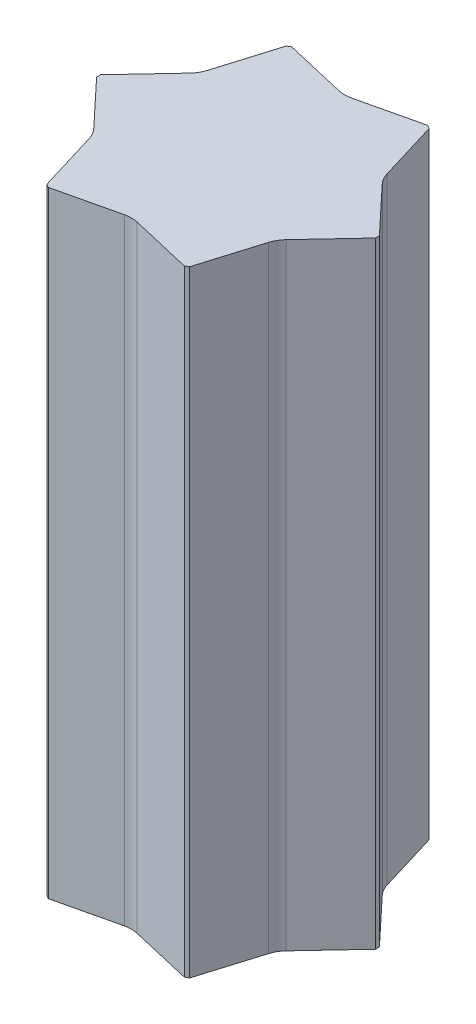
ISO-10303-21;
HEADER;
FILE_DESCRIPTION(('STEP AP214'),'2;1');
FILE_NAME('part.step','',(''),(''),'','','');
FILE_SCHEMA(('AUTOMOTIVE_DESIGN { 1 0 10303 214 1 1 1 1 }'));
ENDSEC;
DATA;
#1=APPLICATION_CONTEXT('core data for automotive mechanical design processes');
#2=APPLICATION_PROTOCOL_DEFINITION('international standard','automotive_design',2000,#1);
#3=PRODUCT_CONTEXT('',#1,'mechanical');
#4=PRODUCT('Part','Part','',(#3));
#5=PRODUCT_RELATED_PRODUCT_CATEGORY('part','',(#4));
#6=PRODUCT_DEFINITION_FORMATION('','',#4);
#7=PRODUCT_DEFINITION_CONTEXT('part definition',#1,'design');
#8=PRODUCT_DEFINITION('design','',#6,#7);
#9=PRODUCT_DEFINITION_SHAPE('','',#8);
#10=(LENGTH_UNIT() NAMED_UNIT(*) SI_UNIT(.MILLI.,.METRE.));
#11=(NAMED_UNIT(*) PLANE_ANGLE_UNIT() SI_UNIT($,.RADIAN.));
#12=(NAMED_UNIT(*) SI_UNIT($,.STERADIAN.) SOLID_ANGLE_UNIT());
#13=UNCERTAINTY_MEASURE_WITH_UNIT(LENGTH_MEASURE(1.E-05),#10,'distance_accuracy_value','');
#14=(GEOMETRIC_REPRESENTATION_CONTEXT(3) GLOBAL_UNCERTAINTY_ASSIGNED_CONTEXT((#13)) GLOBAL_UNIT_ASSIGNED_CONTEXT((#10,
#11,#12)) REPRESENTATION_CONTEXT('',''));
#15=CARTESIAN_POINT('',(0.,0.,0.));
#16=DIRECTION('',(0.,0.,1.));
#17=DIRECTION('',(1.,0.,0.));
#18=AXIS2_PLACEMENT_3D('',#15,#16,#17);
#19=CARTESIAN_POINT('',(-15.2728406860459,1480.,-257.829132307573));
#20=DIRECTION('',(-0.227684068601676,0.,0.97373505888665));
#21=DIRECTION('',(0.97373505888665,0.,0.227684068601676));
#22=AXIS2_PLACEMENT_3D('',#19,#20,#21);
#23=PLANE('',#22);
#24=DIRECTION('',(-0.97373505888665,0.,-0.227684068601676));
#25=VECTOR('',#24,1.);
#26=CARTESIAN_POINT('',(-15.2728406860459,0.,-257.829132307573));
#27=LINE('',#26,#25);
#28=CARTESIAN_POINT('',(-15.2728407370872,0.,-257.829132089557));
#29=VERTEX_POINT('',#28);
#30=CARTESIAN_POINT('',(-163.42540728603,0.,-292.470977468036));
#31=VERTEX_POINT('',#30);
#32=EDGE_CURVE('E243',#29,#31,#27,.T.);
#33=ORIENTED_EDGE('',*,*,#32,.T.);
#34=DIRECTION('',(0.,-1.,0.));
#35=VECTOR('',#34,1.);
#36=CARTESIAN_POINT('',(-163.42540728603,1480.,-292.470977468036));
#37=LINE('',#36,#35);
#38=CARTESIAN_POINT('',(-163.42540728603,1480.,-292.470977468036));
#39=VERTEX_POINT('',#38);
#40=EDGE_CURVE('E11',#39,#31,#37,.T.);
#41=ORIENTED_EDGE('',*,*,#40,.F.);
#42=DIRECTION('',(-0.97373505888665,0.,-0.227684068601676));
#43=VECTOR('',#42,1.);
#44=CARTESIAN_POINT('',(-15.2728406860459,1480.,-257.829132307573));
#45=LINE('',#44,#43);
#46=CARTESIAN_POINT('',(-15.2728407370872,1480.,-257.829132089557));
#47=VERTEX_POINT('',#46);
#48=EDGE_CURVE('E311',#47,#39,#45,.T.);
#49=ORIENTED_EDGE('',*,*,#48,.F.);
#50=DIRECTION('',(0.,-1.,0.));
#51=VECTOR('',#50,1.);
#52=CARTESIAN_POINT('',(-15.2728407370872,1480.,-257.829132089557));
#53=LINE('',#52,#51);
#54=EDGE_CURVE('E239',#47,#29,#53,.T.);
#55=ORIENTED_EDGE('',*,*,#54,.T.);
#56=EDGE_LOOP('',(#33,#41,#49,#55));
#57=FACE_BOUND('',#56,.T.);
#58=ADVANCED_FACE('F43',(#57),#23,.F.);
#59=CARTESIAN_POINT('',(-163.42540728603,1480.,-292.470977468036));
#60=DIRECTION('',(0.499999999999996,0.,0.866025403784441));
#61=DIRECTION('',(0.866025403784441,0.,-0.499999999999996));
#62=AXIS2_PLACEMENT_3D('',#59,#60,#61);
#63=PLANE('',#62);
#64=DIRECTION('',(-0.866025403784441,0.,0.499999999999996));
#65=VECTOR('',#64,1.);
#66=CARTESIAN_POINT('',(-163.42540728603,0.,-292.470977468036));
#67=LINE('',#66,#65);
#68=CARTESIAN_POINT('',(-171.57459271397,0.,-287.766043067538));
#69=VERTEX_POINT('',#68);
#70=EDGE_CURVE('E247',#31,#69,#67,.T.);
#71=ORIENTED_EDGE('',*,*,#70,.T.);
#72=DIRECTION('',(0.,-1.,0.));
#73=VECTOR('',#72,1.);
#74=CARTESIAN_POINT('',(-171.57459271397,1480.,-287.766043067538));
#75=LINE('',#74,#73);
#76=CARTESIAN_POINT('',(-171.57459271397,1480.,-287.766043067538));
#77=VERTEX_POINT('',#76);
#78=EDGE_CURVE('E52',#77,#69,#75,.T.);
#79=ORIENTED_EDGE('',*,*,#78,.F.);
#80=DIRECTION('',(-0.866025403784441,0.,0.499999999999996));
#81=VECTOR('',#80,1.);
#82=CARTESIAN_POINT('',(-163.42540728603,1480.,-292.470977468036));
#83=LINE('',#82,#81);
#84=EDGE_CURVE('E151',#39,#77,#83,.T.);
#85=ORIENTED_EDGE('',*,*,#84,.F.);
#86=ORIENTED_EDGE('',*,*,#40,.T.);
#87=EDGE_LOOP('',(#71,#79,#85,#86));
#88=FACE_BOUND('',#87,.T.);
#89=ADVANCED_FACE('F544',(#88),#63,.F.);
#90=CARTESIAN_POINT('',(-171.57459271397,1480.,-287.766043067538));
#91=DIRECTION('',(0.957121330849985,0.,0.289687345308616));
#92=DIRECTION('',(0.289687345308616,0.,-0.957121330849985));
#93=AXIS2_PLACEMENT_3D('',#90,#91,#92);
#94=PLANE('',#93);
#95=DIRECTION('',(-0.289687345308616,0.,0.957121330849985));
#96=VECTOR('',#95,1.);
#97=CARTESIAN_POINT('',(-171.57459271397,0.,-287.766043067538));
#98=LINE('',#97,#96);
#99=CARTESIAN_POINT('',(-215.64921863951,0.,-142.14433985635));
#100=VERTEX_POINT('',#99);
#101=EDGE_CURVE('E250',#69,#100,#98,.T.);
#102=ORIENTED_EDGE('',*,*,#101,.T.);
#103=DIRECTION('',(0.,-1.,0.));
#104=VECTOR('',#103,1.);
#105=CARTESIAN_POINT('',(-215.64921863951,1480.,-142.14433985635));
#106=LINE('',#105,#104);
#107=CARTESIAN_POINT('',(-215.64921863951,1480.,-142.14433985635));
#108=VERTEX_POINT('',#107);
#109=EDGE_CURVE('E386',#108,#100,#106,.T.);
#110=ORIENTED_EDGE('',*,*,#109,.F.);
#111=DIRECTION('',(-0.289687345308616,0.,0.957121330849985));
#112=VECTOR('',#111,1.);
#113=CARTESIAN_POINT('',(-171.57459271397,1480.,-287.766043067538));
#114=LINE('',#113,#112);
#115=EDGE_CURVE('E398',#77,#108,#114,.T.);
#116=ORIENTED_EDGE('',*,*,#115,.F.);
#117=ORIENTED_EDGE('',*,*,#78,.T.);
#118=EDGE_LOOP('',(#102,#110,#116,#117));
#119=FACE_BOUND('',#118,.T.);
#120=ADVANCED_FACE('F396',(#119),#94,.F.);
#121=CARTESIAN_POINT('',(-279.782642064786,1480.,-161.532583710705));
#122=DIRECTION('',(0.,-1.,0.));
#123=DIRECTION('',(0.,0.,-1.));
#124=AXIS2_PLACEMENT_3D('',#121,#122,#123);
#125=CYLINDRICAL_SURFACE('',#124,66.9999997761003);
#126=CARTESIAN_POINT('',(-279.782642064786,0.,-161.532583710705));
#127=DIRECTION('',(0.,-1.,0.));
#128=DIRECTION('',(0.,0.,1.));
#129=AXIS2_PLACEMENT_3D('',#126,#127,#128);
#130=CIRCLE('',#129,66.9999997761003);
#131=CARTESIAN_POINT('',(-230.92299859379,0.,-115.6878979785));
#132=VERTEX_POINT('',#131);
#133=EDGE_CURVE('E253',#100,#132,#130,.T.);
#134=ORIENTED_EDGE('',*,*,#133,.T.);
#135=DIRECTION('',(0.,-1.,0.));
#136=VECTOR('',#135,1.);
#137=CARTESIAN_POINT('',(-230.92299859379,1480.,-115.6878979785));
#138=LINE('',#137,#136);
#139=CARTESIAN_POINT('',(-230.92299859379,1480.,-115.6878979785));
#140=VERTEX_POINT('',#139);
#141=EDGE_CURVE('E382',#140,#132,#138,.T.);
#142=ORIENTED_EDGE('',*,*,#141,.F.);
#143=CARTESIAN_POINT('',(-279.782642064786,1480.,-161.532583710705));
#144=DIRECTION('',(0.,-1.,0.));
#145=DIRECTION('',(0.,0.,1.));
#146=AXIS2_PLACEMENT_3D('',#143,#144,#145);
#147=CIRCLE('',#146,66.9999997761003);
#148=EDGE_CURVE('E417',#108,#140,#147,.T.);
#149=ORIENTED_EDGE('',*,*,#148,.F.);
#150=ORIENTED_EDGE('',*,*,#109,.T.);
#151=EDGE_LOOP('',(#134,#142,#149,#150));
#152=FACE_BOUND('',#151,.T.);
#153=ADVANCED_FACE('F407',(#152),#125,.F.);
#154=CARTESIAN_POINT('',(-230.922998757077,1480.,-115.687898131711));
#155=DIRECTION('',(0.729437263250537,0.,0.684047716889375));
#156=DIRECTION('',(0.684047716889375,0.,-0.729437263250537));
#157=AXIS2_PLACEMENT_3D('',#154,#155,#156);
#158=PLANE('',#157);
#159=DIRECTION('',(-0.684047716889375,0.,0.729437263250537));
#160=VECTOR('',#159,1.);
#161=CARTESIAN_POINT('',(-230.922998757077,0.,-115.687898131711));
#162=LINE('',#161,#160);
#163=CARTESIAN_POINT('',(-334.999999999997,0.,-4.70493440049));
#164=VERTEX_POINT('',#163);
#165=EDGE_CURVE('E256',#132,#164,#162,.T.);
#166=ORIENTED_EDGE('',*,*,#165,.T.);
#167=DIRECTION('',(0.,-1.,0.));
#168=VECTOR('',#167,1.);
#169=CARTESIAN_POINT('',(-334.999999999997,1480.,-4.70493440049));
#170=LINE('',#169,#168);
#171=CARTESIAN_POINT('',(-334.999999999997,1480.,-4.70493440049));
#172=VERTEX_POINT('',#171);
#173=EDGE_CURVE('E378',#172,#164,#170,.T.);
#174=ORIENTED_EDGE('',*,*,#173,.F.);
#175=DIRECTION('',(-0.684047716889375,0.,0.729437263250537));
#176=VECTOR('',#175,1.);
#177=CARTESIAN_POINT('',(-230.922998757077,1480.,-115.687898131711));
#178=LINE('',#177,#176);
#179=EDGE_CURVE('E413',#140,#172,#178,.T.);
#180=ORIENTED_EDGE('',*,*,#179,.F.);
#181=ORIENTED_EDGE('',*,*,#141,.T.);
#182=EDGE_LOOP('',(#166,#174,#180,#181));
#183=FACE_BOUND('',#182,.T.);
#184=ADVANCED_FACE('F411',(#183),#158,.F.);
#185=CARTESIAN_POINT('',(-334.999999999997,1480.,-4.70493440049));
#186=DIRECTION('',(1.,0.,2.00574437516553E-13));
#187=DIRECTION('',(2.00574437516553E-13,0.,-1.));
#188=AXIS2_PLACEMENT_3D('',#185,#186,#187);
#189=PLANE('',#188);
#190=DIRECTION('',(-2.00574437516553E-13,0.,1.));
#191=VECTOR('',#190,1.);
#192=CARTESIAN_POINT('',(-334.999999999997,0.,-4.70493440049));
#193=LINE('',#192,#191);
#194=CARTESIAN_POINT('',(-334.999999999999,0.,4.70493440049821));
#195=VERTEX_POINT('',#194);
#196=EDGE_CURVE('E259',#164,#195,#193,.T.);
#197=ORIENTED_EDGE('',*,*,#196,.T.);
#198=DIRECTION('',(0.,-1.,0.));
#199=VECTOR('',#198,1.);
#200=CARTESIAN_POINT('',(-334.999999999999,1480.,4.70493440049821));
#201=LINE('',#200,#199);
#202=CARTESIAN_POINT('',(-334.999999999999,1480.,4.70493440049821));
#203=VERTEX_POINT('',#202);
#204=EDGE_CURVE('E374',#203,#195,#201,.T.);
#205=ORIENTED_EDGE('',*,*,#204,.F.);
#206=DIRECTION('',(-2.00574437516553E-13,0.,1.));
#207=VECTOR('',#206,1.);
#208=CARTESIAN_POINT('',(-334.999999999997,1480.,-4.70493440049));
#209=LINE('',#208,#207);
#210=EDGE_CURVE('E416',#172,#203,#209,.T.);
#211=ORIENTED_EDGE('',*,*,#210,.F.);
#212=ORIENTED_EDGE('',*,*,#173,.T.);
#213=EDGE_LOOP('',(#197,#205,#211,#212));
#214=FACE_BOUND('',#213,.T.);
#215=ADVANCED_FACE('F556',(#214),#189,.F.);
#216=CARTESIAN_POINT('',(-334.999999999999,1480.,4.70493440049821));
#217=DIRECTION('',(0.72943726561714,0.,-0.684047714365738));
#218=DIRECTION('',(-0.684047714365738,0.,-0.72943726561714));
#219=AXIS2_PLACEMENT_3D('',#216,#217,#218);
#220=PLANE('',#219);
#221=DIRECTION('',(0.684047714365738,0.,0.72943726561714));
#222=VECTOR('',#221,1.);
#223=CARTESIAN_POINT('',(-334.999999999999,0.,4.70493440049821));
#224=LINE('',#223,#222);
#225=CARTESIAN_POINT('',(-230.92521863952,0.,115.685531719912));
#226=VERTEX_POINT('',#225);
#227=EDGE_CURVE('E261',#195,#226,#224,.T.);
#228=ORIENTED_EDGE('',*,*,#227,.T.);
#229=DIRECTION('',(0.,-1.,0.));
#230=VECTOR('',#229,1.);
#231=CARTESIAN_POINT('',(-230.92521863952,1480.,115.685531719912));
#232=LINE('',#231,#230);
#233=CARTESIAN_POINT('',(-230.92521863952,1480.,115.685531719912));
#234=VERTEX_POINT('',#233);
#235=EDGE_CURVE('E370',#234,#226,#232,.T.);
#236=ORIENTED_EDGE('',*,*,#235,.F.);
#237=DIRECTION('',(0.684047714365738,0.,0.72943726561714));
#238=VECTOR('',#237,1.);
#239=CARTESIAN_POINT('',(-334.999999999999,1480.,4.70493440049821));
#240=LINE('',#239,#238);
#241=EDGE_CURVE('E422',#203,#234,#240,.T.);
#242=ORIENTED_EDGE('',*,*,#241,.F.);
#243=ORIENTED_EDGE('',*,*,#204,.T.);
#244=EDGE_LOOP('',(#228,#236,#242,#243));
#245=FACE_BOUND('',#244,.T.);
#246=ADVANCED_FACE('F559',(#245),#220,.F.);
#247=CARTESIAN_POINT('',(-279.782642064794,1480.,161.53258371069));
#248=DIRECTION('',(0.,-1.,0.));
#249=DIRECTION('',(0.,0.,-1.));
#250=AXIS2_PLACEMENT_3D('',#247,#248,#249);
#251=CYLINDRICAL_SURFACE('',#250,66.9999997761002);
#252=CARTESIAN_POINT('',(-279.782642064794,0.,161.53258371069));
#253=DIRECTION('',(0.,-1.,0.));
#254=DIRECTION('',(0.,0.,1.));
#255=AXIS2_PLACEMENT_3D('',#252,#253,#254);
#256=CIRCLE('',#255,66.9999997761002);
#257=CARTESIAN_POINT('',(-215.650157856694,0.,142.141234111057));
#258=VERTEX_POINT('',#257);
#259=EDGE_CURVE('E264',#226,#258,#256,.T.);
#260=ORIENTED_EDGE('',*,*,#259,.T.);
#261=DIRECTION('',(0.,-1.,0.));
#262=VECTOR('',#261,1.);
#263=CARTESIAN_POINT('',(-215.650157856694,1480.,142.141234111057));
#264=LINE('',#263,#262);
#265=CARTESIAN_POINT('',(-215.650157856694,1480.,142.141234111057));
#266=VERTEX_POINT('',#265);
#267=EDGE_CURVE('E366',#266,#258,#264,.T.);
#268=ORIENTED_EDGE('',*,*,#267,.F.);
#269=CARTESIAN_POINT('',(-279.782642064794,1480.,161.53258371069));
#270=DIRECTION('',(0.,-1.,0.));
#271=DIRECTION('',(0.,0.,1.));
#272=AXIS2_PLACEMENT_3D('',#269,#270,#271);
#273=CIRCLE('',#272,66.9999997761002);
#274=EDGE_CURVE('E430',#234,#266,#273,.T.);
#275=ORIENTED_EDGE('',*,*,#274,.F.);
#276=ORIENTED_EDGE('',*,*,#235,.T.);
#277=EDGE_LOOP('',(#260,#268,#275,#276));
#278=FACE_BOUND('',#277,.T.);
#279=ADVANCED_FACE('F563',(#278),#251,.F.);
#280=CARTESIAN_POINT('',(-215.650158071023,1480.,142.141234175862));
#281=DIRECTION('',(0.957121331852214,0.,-0.28968734199727));
#282=DIRECTION('',(-0.28968734199727,0.,-0.957121331852215));
#283=AXIS2_PLACEMENT_3D('',#280,#281,#282);
#284=PLANE('',#283);
#285=DIRECTION('',(0.28968734199727,0.,0.957121331852214));
#286=VECTOR('',#285,1.);
#287=CARTESIAN_POINT('',(-215.650158071023,0.,142.141234175862));
#288=LINE('',#287,#286);
#289=CARTESIAN_POINT('',(-171.574592713959,0.,287.766043067545));
#290=VERTEX_POINT('',#289);
#291=EDGE_CURVE('E267',#258,#290,#288,.T.);
#292=ORIENTED_EDGE('',*,*,#291,.T.);
#293=DIRECTION('',(0.,-1.,0.));
#294=VECTOR('',#293,1.);
#295=CARTESIAN_POINT('',(-171.574592713959,1480.,287.766043067545));
#296=LINE('',#295,#294);
#297=CARTESIAN_POINT('',(-171.574592713959,1480.,287.766043067545));
#298=VERTEX_POINT('',#297);
#299=EDGE_CURVE('E362',#298,#290,#296,.T.);
#300=ORIENTED_EDGE('',*,*,#299,.F.);
#301=DIRECTION('',(0.28968734199727,0.,0.957121331852214));
#302=VECTOR('',#301,1.);
#303=CARTESIAN_POINT('',(-215.650158071023,1480.,142.141234175862));
#304=LINE('',#303,#302);
#305=EDGE_CURVE('E432',#266,#298,#304,.T.);
#306=ORIENTED_EDGE('',*,*,#305,.F.);
#307=ORIENTED_EDGE('',*,*,#267,.T.);
#308=EDGE_LOOP('',(#292,#300,#306,#307));
#309=FACE_BOUND('',#308,.T.);
#310=ADVANCED_FACE('F567',(#309),#284,.F.);
#311=CARTESIAN_POINT('',(-171.574592713959,1480.,287.766043067545));
#312=DIRECTION('',(0.499999999999954,0.,-0.866025403784465));
#313=DIRECTION('',(-0.866025403784465,0.,-0.499999999999954));
#314=AXIS2_PLACEMENT_3D('',#311,#312,#313);
#315=PLANE('',#314);
#316=DIRECTION('',(0.866025403784465,0.,0.499999999999954));
#317=VECTOR('',#316,1.);
#318=CARTESIAN_POINT('',(-171.574592713959,0.,287.766043067545));
#319=LINE('',#318,#317);
#320=CARTESIAN_POINT('',(-163.42540728603,0.,292.470977468036));
#321=VERTEX_POINT('',#320);
#322=EDGE_CURVE('E270',#290,#321,#319,.T.);
#323=ORIENTED_EDGE('',*,*,#322,.T.);
#324=DIRECTION('',(0.,-1.,0.));
#325=VECTOR('',#324,1.);
#326=CARTESIAN_POINT('',(-163.42540728603,1480.,292.470977468036));
#327=LINE('',#326,#325);
#328=CARTESIAN_POINT('',(-163.42540728603,1480.,292.470977468036));
#329=VERTEX_POINT('',#328);
#330=EDGE_CURVE('E358',#329,#321,#327,.T.);
#331=ORIENTED_EDGE('',*,*,#330,.F.);
#332=DIRECTION('',(0.866025403784465,0.,0.499999999999954));
#333=VECTOR('',#332,1.);
#334=CARTESIAN_POINT('',(-171.574592713959,1480.,287.766043067545));
#335=LINE('',#334,#333);
#336=EDGE_CURVE('E435',#298,#329,#335,.T.);
#337=ORIENTED_EDGE('',*,*,#336,.F.);
#338=ORIENTED_EDGE('',*,*,#299,.T.);
#339=EDGE_LOOP('',(#323,#331,#337,#338));
#340=FACE_BOUND('',#339,.T.);
#341=ADVANCED_FACE('F571',(#340),#315,.F.);
#342=CARTESIAN_POINT('',(-163.42540728603,1480.,292.470977468036));
#343=DIRECTION('',(-0.227684065232771,0.,-0.973735059674386));
#344=DIRECTION('',(-0.973735059674386,0.,0.227684065232771));
#345=AXIS2_PLACEMENT_3D('',#342,#343,#344);
#346=PLANE('',#345);
#347=DIRECTION('',(0.973735059674385,0.,-0.227684065232771));
#348=VECTOR('',#347,1.);
#349=CARTESIAN_POINT('',(-163.42540728603,0.,292.470977468036));
#350=LINE('',#349,#348);
#351=CARTESIAN_POINT('',(-15.2760000000023,0.,257.829871576267));
#352=VERTEX_POINT('',#351);
#353=EDGE_CURVE('E273',#321,#352,#350,.T.);
#354=ORIENTED_EDGE('',*,*,#353,.T.);
#355=DIRECTION('',(0.,-1.,0.));
#356=VECTOR('',#355,1.);
#357=CARTESIAN_POINT('',(-15.2760000000023,1480.,257.829871576267));
#358=LINE('',#357,#356);
#359=CARTESIAN_POINT('',(-15.2760000000023,1480.,257.829871576267));
#360=VERTEX_POINT('',#359);
#361=EDGE_CURVE('E354',#360,#352,#358,.T.);
#362=ORIENTED_EDGE('',*,*,#361,.F.);
#363=DIRECTION('',(0.973735059674385,0.,-0.227684065232771));
#364=VECTOR('',#363,1.);
#365=CARTESIAN_POINT('',(-163.42540728603,1480.,292.470977468036));
#366=LINE('',#365,#364);
#367=EDGE_CURVE('E438',#329,#360,#366,.T.);
#368=ORIENTED_EDGE('',*,*,#367,.F.);
#369=ORIENTED_EDGE('',*,*,#330,.T.);
#370=EDGE_LOOP('',(#354,#362,#368,#369));
#371=FACE_BOUND('',#370,.T.);
#372=ADVANCED_FACE('F575',(#371),#346,.F.);
#373=CARTESIAN_POINT('',(-2.25942145351596E-12,1480.,323.065167421386));
#374=DIRECTION('',(0.,-1.,0.));
#375=DIRECTION('',(0.,0.,-1.));
#376=AXIS2_PLACEMENT_3D('',#373,#374,#375);
#377=CYLINDRICAL_SURFACE('',#376,66.9999997760901);
#378=CARTESIAN_POINT('',(-2.25942145351596E-12,0.,323.065167421386));
#379=DIRECTION('',(0.,-1.,0.));
#380=DIRECTION('',(0.,0.,1.));
#381=AXIS2_PLACEMENT_3D('',#378,#379,#380);
#382=CIRCLE('',#381,66.9999997760901);
#383=CARTESIAN_POINT('',(15.2728407371016,0.,257.829132089561));
#384=VERTEX_POINT('',#383);
#385=EDGE_CURVE('E276',#352,#384,#382,.T.);
#386=ORIENTED_EDGE('',*,*,#385,.T.);
#387=DIRECTION('',(0.,-1.,0.));
#388=VECTOR('',#387,1.);
#389=CARTESIAN_POINT('',(15.2728407371016,1480.,257.829132089561));
#390=LINE('',#389,#388);
#391=CARTESIAN_POINT('',(15.2728407371016,1480.,257.829132089561));
#392=VERTEX_POINT('',#391);
#393=EDGE_CURVE('E350',#392,#384,#390,.T.);
#394=ORIENTED_EDGE('',*,*,#393,.F.);
#395=CARTESIAN_POINT('',(-2.25942145351596E-12,1480.,323.065167421386));
#396=DIRECTION('',(0.,-1.,0.));
#397=DIRECTION('',(0.,0.,1.));
#398=AXIS2_PLACEMENT_3D('',#395,#396,#397);
#399=CIRCLE('',#398,66.9999997760901);
#400=EDGE_CURVE('E441',#360,#392,#399,.T.);
#401=ORIENTED_EDGE('',*,*,#400,.F.);
#402=ORIENTED_EDGE('',*,*,#361,.T.);
#403=EDGE_LOOP('',(#386,#394,#401,#402));
#404=FACE_BOUND('',#403,.T.);
#405=ADVANCED_FACE('F579',(#404),#377,.F.);
#406=CARTESIAN_POINT('',(15.2728406860604,1480.,257.829132307577));
#407=DIRECTION('',(0.227684068601661,0.,-0.973735058886653));
#408=DIRECTION('',(-0.973735058886653,0.,-0.227684068601661));
#409=AXIS2_PLACEMENT_3D('',#406,#407,#408);
#410=PLANE('',#409);
#411=DIRECTION('',(0.973735058886653,0.,0.227684068601661));
#412=VECTOR('',#411,1.);
#413=CARTESIAN_POINT('',(15.2728406860604,0.,257.829132307577));
#414=LINE('',#413,#412);
#415=CARTESIAN_POINT('',(163.425407286042,0.,292.470977468036));
#416=VERTEX_POINT('',#415);
#417=EDGE_CURVE('E279',#384,#416,#414,.T.);
#418=ORIENTED_EDGE('',*,*,#417,.T.);
#419=DIRECTION('',(0.,-1.,0.));
#420=VECTOR('',#419,1.);
#421=CARTESIAN_POINT('',(163.425407286042,1480.,292.470977468036));
#422=LINE('',#421,#420);
#423=CARTESIAN_POINT('',(163.425407286042,1480.,292.470977468036));
#424=VERTEX_POINT('',#423);
#425=EDGE_CURVE('E346',#424,#416,#422,.T.);
#426=ORIENTED_EDGE('',*,*,#425,.F.);
#427=DIRECTION('',(0.973735058886653,0.,0.227684068601661));
#428=VECTOR('',#427,1.);
#429=CARTESIAN_POINT('',(15.2728406860604,1480.,257.829132307577));
#430=LINE('',#429,#428);
#431=EDGE_CURVE('E444',#392,#424,#430,.T.);
#432=ORIENTED_EDGE('',*,*,#431,.F.);
#433=ORIENTED_EDGE('',*,*,#393,.T.);
#434=EDGE_LOOP('',(#418,#426,#432,#433));
#435=FACE_BOUND('',#434,.T.);
#436=ADVANCED_FACE('F583',(#435),#410,.F.);
#437=CARTESIAN_POINT('',(163.425407286042,1480.,292.470977468036));
#438=DIRECTION('',(-0.500000000000429,0.,-0.866025403784191));
#439=DIRECTION('',(-0.866025403784191,0.,0.500000000000429));
#440=AXIS2_PLACEMENT_3D('',#437,#438,#439);
#441=PLANE('',#440);
#442=DIRECTION('',(0.866025403784191,0.,-0.500000000000429));
#443=VECTOR('',#442,1.);
#444=CARTESIAN_POINT('',(163.425407286042,0.,292.470977468036));
#445=LINE('',#444,#443);
#446=CARTESIAN_POINT('',(171.574592713969,0.,287.766043067541));
#447=VERTEX_POINT('',#446);
#448=EDGE_CURVE('E282',#416,#447,#445,.T.);
#449=ORIENTED_EDGE('',*,*,#448,.T.);
#450=DIRECTION('',(0.,-1.,0.));
#451=VECTOR('',#450,1.);
#452=CARTESIAN_POINT('',(171.574592713969,1480.,287.766043067541));
#453=LINE('',#452,#451);
#454=CARTESIAN_POINT('',(171.574592713969,1480.,287.766043067541));
#455=VERTEX_POINT('',#454);
#456=EDGE_CURVE('E342',#455,#447,#453,.T.);
#457=ORIENTED_EDGE('',*,*,#456,.F.);
#458=DIRECTION('',(0.866025403784191,0.,-0.500000000000429));
#459=VECTOR('',#458,1.);
#460=CARTESIAN_POINT('',(163.425407286042,1480.,292.470977468036));
#461=LINE('',#460,#459);
#462=EDGE_CURVE('E447',#424,#455,#461,.T.);
#463=ORIENTED_EDGE('',*,*,#462,.F.);
#464=ORIENTED_EDGE('',*,*,#425,.T.);
#465=EDGE_LOOP('',(#449,#457,#463,#464));
#466=FACE_BOUND('',#465,.T.);
#467=ADVANCED_FACE('F587',(#466),#441,.F.);
#468=CARTESIAN_POINT('',(171.574592713969,1480.,287.766043067541));
#469=DIRECTION('',(-0.957121330849957,0.,-0.289687345308709));
#470=DIRECTION('',(-0.289687345308709,0.,0.957121330849957));
#471=AXIS2_PLACEMENT_3D('',#468,#469,#470);
#472=PLANE('',#471);
#473=DIRECTION('',(0.289687345308709,0.,-0.957121330849957));
#474=VECTOR('',#473,1.);
#475=CARTESIAN_POINT('',(171.574592713969,0.,287.766043067541));
#476=LINE('',#475,#474);
#477=CARTESIAN_POINT('',(215.649218639527,0.,142.144339856345));
#478=VERTEX_POINT('',#477);
#479=EDGE_CURVE('E285',#447,#478,#476,.T.);
#480=ORIENTED_EDGE('',*,*,#479,.T.);
#481=DIRECTION('',(0.,-1.,0.));
#482=VECTOR('',#481,1.);
#483=CARTESIAN_POINT('',(215.649218639527,1480.,142.144339856345));
#484=LINE('',#483,#482);
#485=CARTESIAN_POINT('',(215.649218639527,1480.,142.144339856345));
#486=VERTEX_POINT('',#485);
#487=EDGE_CURVE('E338',#486,#478,#484,.T.);
#488=ORIENTED_EDGE('',*,*,#487,.F.);
#489=DIRECTION('',(0.289687345308709,0.,-0.957121330849957));
#490=VECTOR('',#489,1.);
#491=CARTESIAN_POINT('',(171.574592713969,1480.,287.766043067541));
#492=LINE('',#491,#490);
#493=EDGE_CURVE('E450',#455,#486,#492,.T.);
#494=ORIENTED_EDGE('',*,*,#493,.F.);
#495=ORIENTED_EDGE('',*,*,#456,.T.);
#496=EDGE_LOOP('',(#480,#488,#494,#495));
#497=FACE_BOUND('',#496,.T.);
#498=ADVANCED_FACE('F591',(#497),#472,.F.);
#499=CARTESIAN_POINT('',(279.782642064801,1480.,161.532583710706));
#500=DIRECTION('',(0.,-1.,0.));
#501=DIRECTION('',(0.,0.,-1.));
#502=AXIS2_PLACEMENT_3D('',#499,#500,#501);
#503=CYLINDRICAL_SURFACE('',#502,66.9999997761001);
#504=CARTESIAN_POINT('',(279.782642064801,0.,161.532583710706));
#505=DIRECTION('',(0.,-1.,0.));
#506=DIRECTION('',(0.,0.,1.));
#507=AXIS2_PLACEMENT_3D('',#504,#505,#506);
#508=CIRCLE('',#507,66.9999997761001);
#509=CARTESIAN_POINT('',(230.922998593805,0.,115.687897978501));
#510=VERTEX_POINT('',#509);
#511=EDGE_CURVE('E287',#478,#510,#508,.T.);
#512=ORIENTED_EDGE('',*,*,#511,.T.);
#513=DIRECTION('',(0.,-1.,0.));
#514=VECTOR('',#513,1.);
#515=CARTESIAN_POINT('',(230.922998593805,1480.,115.687897978501));
#516=LINE('',#515,#514);
#517=CARTESIAN_POINT('',(230.922998593805,1480.,115.687897978501));
#518=VERTEX_POINT('',#517);
#519=EDGE_CURVE('E334',#518,#510,#516,.T.);
#520=ORIENTED_EDGE('',*,*,#519,.F.);
#521=CARTESIAN_POINT('',(279.782642064801,1480.,161.532583710706));
#522=DIRECTION('',(0.,-1.,0.));
#523=DIRECTION('',(0.,0.,1.));
#524=AXIS2_PLACEMENT_3D('',#521,#522,#523);
#525=CIRCLE('',#524,66.9999997761001);
#526=EDGE_CURVE('E453',#486,#518,#525,.T.);
#527=ORIENTED_EDGE('',*,*,#526,.F.);
#528=ORIENTED_EDGE('',*,*,#487,.T.);
#529=EDGE_LOOP('',(#512,#520,#527,#528));
#530=FACE_BOUND('',#529,.T.);
#531=ADVANCED_FACE('F595',(#530),#503,.F.);
#532=CARTESIAN_POINT('',(230.922998757093,1480.,115.687898131713));
#533=DIRECTION('',(-0.729437263250538,0.,-0.684047716889374));
#534=DIRECTION('',(-0.684047716889374,0.,0.729437263250538));
#535=AXIS2_PLACEMENT_3D('',#532,#533,#534);
#536=PLANE('',#535);
#537=DIRECTION('',(0.684047716889374,0.,-0.729437263250538));
#538=VECTOR('',#537,1.);
#539=CARTESIAN_POINT('',(230.922998757093,0.,115.687898131713));
#540=LINE('',#539,#538);
#541=CARTESIAN_POINT('',(335.000000000009,0.,4.70493440049482));
#542=VERTEX_POINT('',#541);
#543=EDGE_CURVE('E290',#510,#542,#540,.T.);
#544=ORIENTED_EDGE('',*,*,#543,.T.);
#545=DIRECTION('',(0.,-1.,0.));
#546=VECTOR('',#545,1.);
#547=CARTESIAN_POINT('',(335.000000000009,1480.,4.70493440049482));
#548=LINE('',#547,#546);
#549=CARTESIAN_POINT('',(335.000000000009,1480.,4.70493440049482));
#550=VERTEX_POINT('',#549);
#551=EDGE_CURVE('E330',#550,#542,#548,.T.);
#552=ORIENTED_EDGE('',*,*,#551,.F.);
#553=DIRECTION('',(0.684047716889374,0.,-0.729437263250538));
#554=VECTOR('',#553,1.);
#555=CARTESIAN_POINT('',(230.922998757093,1480.,115.687898131713));
#556=LINE('',#555,#554);
#557=EDGE_CURVE('E456',#518,#550,#556,.T.);
#558=ORIENTED_EDGE('',*,*,#557,.F.);
#559=ORIENTED_EDGE('',*,*,#519,.T.);
#560=EDGE_LOOP('',(#544,#552,#558,#559));
#561=FACE_BOUND('',#560,.T.);
#562=ADVANCED_FACE('F599',(#561),#536,.F.);
#563=CARTESIAN_POINT('',(335.000000000009,1480.,4.70493440049482));
#564=DIRECTION('',(-1.,0.,6.90212034983323E-13));
#565=DIRECTION('',(6.90212034983323E-13,0.,1.));
#566=AXIS2_PLACEMENT_3D('',#563,#564,#565);
#567=PLANE('',#566);
#568=DIRECTION('',(-6.90212034983323E-13,0.,-1.));
#569=VECTOR('',#568,1.);
#570=CARTESIAN_POINT('',(335.000000000009,0.,4.70493440049482));
#571=LINE('',#570,#569);
#572=CARTESIAN_POINT('',(335.000000000003,0.,-4.70493440049486));
#573=VERTEX_POINT('',#572);
#574=EDGE_CURVE('E293',#542,#573,#571,.T.);
#575=ORIENTED_EDGE('',*,*,#574,.T.);
#576=DIRECTION('',(0.,-1.,0.));
#577=VECTOR('',#576,1.);
#578=CARTESIAN_POINT('',(335.000000000003,1480.,-4.70493440049486));
#579=LINE('',#578,#577);
#580=CARTESIAN_POINT('',(335.000000000003,1480.,-4.70493440049486));
#581=VERTEX_POINT('',#580);
#582=EDGE_CURVE('E326',#581,#573,#579,.T.);
#583=ORIENTED_EDGE('',*,*,#582,.F.);
#584=DIRECTION('',(-6.90212034983323E-13,0.,-1.));
#585=VECTOR('',#584,1.);
#586=CARTESIAN_POINT('',(335.000000000009,1480.,4.70493440049482));
#587=LINE('',#586,#585);
#588=EDGE_CURVE('E459',#550,#581,#587,.T.);
#589=ORIENTED_EDGE('',*,*,#588,.F.);
#590=ORIENTED_EDGE('',*,*,#551,.T.);
#591=EDGE_LOOP('',(#575,#583,#589,#590));
#592=FACE_BOUND('',#591,.T.);
#593=ADVANCED_FACE('F603',(#592),#567,.F.);
#594=CARTESIAN_POINT('',(335.000000000003,1480.,-4.70493440049486));
#595=DIRECTION('',(-0.729437265617185,0.,0.68404771436569));
#596=DIRECTION('',(0.68404771436569,0.,0.729437265617185));
#597=AXIS2_PLACEMENT_3D('',#594,#595,#596);
#598=PLANE('',#597);
#599=DIRECTION('',(-0.68404771436569,0.,-0.729437265617185));
#600=VECTOR('',#599,1.);
#601=CARTESIAN_POINT('',(335.000000000003,0.,-4.70493440049486));
#602=LINE('',#601,#600);
#603=CARTESIAN_POINT('',(230.925218639535,0.,-115.685531719912));
#604=VERTEX_POINT('',#603);
#605=EDGE_CURVE('E296',#573,#604,#602,.T.);
#606=ORIENTED_EDGE('',*,*,#605,.T.);
#607=DIRECTION('',(0.,-1.,0.));
#608=VECTOR('',#607,1.);
#609=CARTESIAN_POINT('',(230.925218639535,1480.,-115.685531719912));
#610=LINE('',#609,#608);
#611=CARTESIAN_POINT('',(230.925218639535,1480.,-115.685531719912));
#612=VERTEX_POINT('',#611);
#613=EDGE_CURVE('E322',#612,#604,#610,.T.);
#614=ORIENTED_EDGE('',*,*,#613,.F.);
#615=DIRECTION('',(-0.68404771436569,0.,-0.729437265617185));
#616=VECTOR('',#615,1.);
#617=CARTESIAN_POINT('',(335.000000000003,1480.,-4.70493440049486));
#618=LINE('',#617,#616);
#619=EDGE_CURVE('E462',#581,#612,#618,.T.);
#620=ORIENTED_EDGE('',*,*,#619,.F.);
#621=ORIENTED_EDGE('',*,*,#582,.T.);
#622=EDGE_LOOP('',(#606,#614,#620,#621));
#623=FACE_BOUND('',#622,.T.);
#624=ADVANCED_FACE('F607',(#623),#598,.F.);
#625=CARTESIAN_POINT('',(279.782642064811,1480.,-161.532583710687));
#626=DIRECTION('',(0.,-1.,0.));
#627=DIRECTION('',(0.,0.,-1.));
#628=AXIS2_PLACEMENT_3D('',#625,#626,#627);
#629=CYLINDRICAL_SURFACE('',#628,66.9999997761003);
#630=CARTESIAN_POINT('',(279.782642064811,0.,-161.532583710687));
#631=DIRECTION('',(0.,-1.,0.));
#632=DIRECTION('',(0.,0.,1.));
#633=AXIS2_PLACEMENT_3D('',#630,#631,#632);
#634=CIRCLE('',#633,66.9999997761003);
#635=CARTESIAN_POINT('',(215.65015785671,0.,-142.141234111056));
#636=VERTEX_POINT('',#635);
#637=EDGE_CURVE('E299',#604,#636,#634,.T.);
#638=ORIENTED_EDGE('',*,*,#637,.T.);
#639=DIRECTION('',(0.,-1.,0.));
#640=VECTOR('',#639,1.);
#641=CARTESIAN_POINT('',(215.65015785671,1480.,-142.141234111056));
#642=LINE('',#641,#640);
#643=CARTESIAN_POINT('',(215.65015785671,1480.,-142.141234111056));
#644=VERTEX_POINT('',#643);
#645=EDGE_CURVE('E318',#644,#636,#642,.T.);
#646=ORIENTED_EDGE('',*,*,#645,.F.);
#647=CARTESIAN_POINT('',(279.782642064811,1480.,-161.532583710687));
#648=DIRECTION('',(0.,-1.,0.));
#649=DIRECTION('',(0.,0.,1.));
#650=AXIS2_PLACEMENT_3D('',#647,#648,#649);
#651=CIRCLE('',#650,66.9999997761003);
#652=EDGE_CURVE('E465',#612,#644,#651,.T.);
#653=ORIENTED_EDGE('',*,*,#652,.F.);
#654=ORIENTED_EDGE('',*,*,#613,.T.);
#655=EDGE_LOOP('',(#638,#646,#653,#654));
#656=FACE_BOUND('',#655,.T.);
#657=ADVANCED_FACE('F611',(#656),#629,.F.);
#658=CARTESIAN_POINT('',(215.650158071039,1480.,-142.141234175861));
#659=DIRECTION('',(-0.957121331852202,0.,0.289687341997312));
#660=DIRECTION('',(0.289687341997312,0.,0.957121331852202));
#661=AXIS2_PLACEMENT_3D('',#658,#659,#660);
#662=PLANE('',#661);
#663=DIRECTION('',(-0.289687341997312,0.,-0.957121331852202));
#664=VECTOR('',#663,1.);
#665=CARTESIAN_POINT('',(215.650158071039,0.,-142.141234175861));
#666=LINE('',#665,#664);
#667=CARTESIAN_POINT('',(171.57459271397,0.,-287.766043067538));
#668=VERTEX_POINT('',#667);
#669=EDGE_CURVE('E302',#636,#668,#666,.T.);
#670=ORIENTED_EDGE('',*,*,#669,.T.);
#671=DIRECTION('',(0.,-1.,0.));
#672=VECTOR('',#671,1.);
#673=CARTESIAN_POINT('',(171.57459271397,1480.,-287.766043067538));
#674=LINE('',#673,#672);
#675=CARTESIAN_POINT('',(171.57459271397,1480.,-287.766043067538));
#676=VERTEX_POINT('',#675);
#677=EDGE_CURVE('E229',#676,#668,#674,.T.);
#678=ORIENTED_EDGE('',*,*,#677,.F.);
#679=DIRECTION('',(-0.289687341997312,0.,-0.957121331852202));
#680=VECTOR('',#679,1.);
#681=CARTESIAN_POINT('',(215.650158071039,1480.,-142.141234175861));
#682=LINE('',#681,#680);
#683=EDGE_CURVE('E218',#644,#676,#682,.T.);
#684=ORIENTED_EDGE('',*,*,#683,.F.);
#685=ORIENTED_EDGE('',*,*,#645,.T.);
#686=EDGE_LOOP('',(#670,#678,#684,#685));
#687=FACE_BOUND('',#686,.T.);
#688=ADVANCED_FACE('F615',(#687),#662,.F.);
#689=CARTESIAN_POINT('',(171.57459271397,1480.,-287.766043067538));
#690=DIRECTION('',(-0.499999999999996,0.,0.866025403784441));
#691=DIRECTION('',(0.866025403784441,0.,0.499999999999996));
#692=AXIS2_PLACEMENT_3D('',#689,#690,#691);
#693=PLANE('',#692);
#694=DIRECTION('',(-0.866025403784441,0.,-0.499999999999996));
#695=VECTOR('',#694,1.);
#696=CARTESIAN_POINT('',(171.57459271397,0.,-287.766043067538));
#697=LINE('',#696,#695);
#698=CARTESIAN_POINT('',(163.42540728603,0.,-292.470977468036));
#699=VERTEX_POINT('',#698);
#700=EDGE_CURVE('E227',#668,#699,#697,.T.);
#701=ORIENTED_EDGE('',*,*,#700,.T.);
#702=DIRECTION('',(0.,-1.,0.));
#703=VECTOR('',#702,1.);
#704=CARTESIAN_POINT('',(163.42540728603,1480.,-292.470977468036));
#705=LINE('',#704,#703);
#706=CARTESIAN_POINT('',(163.42540728603,1480.,-292.470977468036));
#707=VERTEX_POINT('',#706);
#708=EDGE_CURVE('E224',#707,#699,#705,.T.);
#709=ORIENTED_EDGE('',*,*,#708,.F.);
#710=DIRECTION('',(-0.866025403784441,0.,-0.499999999999996));
#711=VECTOR('',#710,1.);
#712=CARTESIAN_POINT('',(171.57459271397,1480.,-287.766043067538));
#713=LINE('',#712,#711);
#714=EDGE_CURVE('E212',#676,#707,#713,.T.);
#715=ORIENTED_EDGE('',*,*,#714,.F.);
#716=ORIENTED_EDGE('',*,*,#677,.T.);
#717=EDGE_LOOP('',(#701,#709,#715,#716));
#718=FACE_BOUND('',#717,.T.);
#719=ADVANCED_FACE('F225',(#718),#693,.F.);
#720=CARTESIAN_POINT('',(163.42540728603,1480.,-292.470977468036));
#721=DIRECTION('',(0.227684065232823,0.,0.973735059674373));
#722=DIRECTION('',(0.973735059674373,0.,-0.227684065232823));
#723=AXIS2_PLACEMENT_3D('',#720,#721,#722);
#724=PLANE('',#723);
#725=DIRECTION('',(-0.973735059674373,0.,0.227684065232823));
#726=VECTOR('',#725,1.);
#727=CARTESIAN_POINT('',(163.42540728603,0.,-292.470977468036));
#728=LINE('',#727,#726);
#729=CARTESIAN_POINT('',(15.2760000000169,0.,-257.829871576262));
#730=VERTEX_POINT('',#729);
#731=EDGE_CURVE('E137',#699,#730,#728,.T.);
#732=ORIENTED_EDGE('',*,*,#731,.T.);
#733=DIRECTION('',(0.,-1.,0.));
#734=VECTOR('',#733,1.);
#735=CARTESIAN_POINT('',(15.2760000000169,1480.,-257.829871576262));
#736=LINE('',#735,#734);
#737=CARTESIAN_POINT('',(15.2760000000169,1480.,-257.829871576262));
#738=VERTEX_POINT('',#737);
#739=EDGE_CURVE('E230',#738,#730,#736,.T.);
#740=ORIENTED_EDGE('',*,*,#739,.F.);
#741=DIRECTION('',(-0.973735059674373,0.,0.227684065232823));
#742=VECTOR('',#741,1.);
#743=CARTESIAN_POINT('',(163.42540728603,1480.,-292.470977468036));
#744=LINE('',#743,#742);
#745=EDGE_CURVE('E216',#707,#738,#744,.T.);
#746=ORIENTED_EDGE('',*,*,#745,.F.);
#747=ORIENTED_EDGE('',*,*,#708,.T.);
#748=EDGE_LOOP('',(#732,#740,#746,#747));
#749=FACE_BOUND('',#748,.T.);
#750=ADVANCED_FACE('F232',(#749),#724,.F.);
#751=CARTESIAN_POINT('',(1.8266864299827E-11,1480.,-323.065167421392));
#752=DIRECTION('',(0.,-1.,0.));
#753=DIRECTION('',(0.,0.,-1.));
#754=AXIS2_PLACEMENT_3D('',#751,#752,#753);
#755=CYLINDRICAL_SURFACE('',#754,66.9999997761003);
#756=CARTESIAN_POINT('',(1.8266864299827E-11,0.,-323.065167421392));
#757=DIRECTION('',(0.,-1.,0.));
#758=DIRECTION('',(0.,0.,1.));
#759=AXIS2_PLACEMENT_3D('',#756,#757,#758);
#760=CIRCLE('',#759,66.9999997761003);
#761=EDGE_CURVE('E143',#730,#29,#760,.T.);
#762=ORIENTED_EDGE('',*,*,#761,.T.);
#763=ORIENTED_EDGE('',*,*,#54,.F.);
#764=CARTESIAN_POINT('',(1.8266864299827E-11,1480.,-323.065167421392));
#765=DIRECTION('',(0.,-1.,0.));
#766=DIRECTION('',(0.,0.,1.));
#767=AXIS2_PLACEMENT_3D('',#764,#765,#766);
#768=CIRCLE('',#767,66.9999997761003);
#769=EDGE_CURVE('E60',#738,#47,#768,.T.);
#770=ORIENTED_EDGE('',*,*,#769,.F.);
#771=ORIENTED_EDGE('',*,*,#739,.T.);
#772=EDGE_LOOP('',(#762,#763,#770,#771));
#773=FACE_BOUND('',#772,.T.);
#774=ADVANCED_FACE('F624',(#773),#755,.F.);
#775=CARTESIAN_POINT('',(-279.782642064786,1480.,-161.532583710705));
#776=DIRECTION('',(0.,1.,0.));
#777=DIRECTION('',(0.,0.,1.));
#778=AXIS2_PLACEMENT_3D('',#775,#776,#777);
#779=PLANE('',#778);
#780=ORIENTED_EDGE('',*,*,#48,.T.);
#781=ORIENTED_EDGE('',*,*,#84,.T.);
#782=ORIENTED_EDGE('',*,*,#115,.T.);
#783=ORIENTED_EDGE('',*,*,#148,.T.);
#784=ORIENTED_EDGE('',*,*,#179,.T.);
#785=ORIENTED_EDGE('',*,*,#210,.T.);
#786=ORIENTED_EDGE('',*,*,#241,.T.);
#787=ORIENTED_EDGE('',*,*,#274,.T.);
#788=ORIENTED_EDGE('',*,*,#305,.T.);
#789=ORIENTED_EDGE('',*,*,#336,.T.);
#790=ORIENTED_EDGE('',*,*,#367,.T.);
#791=ORIENTED_EDGE('',*,*,#400,.T.);
#792=ORIENTED_EDGE('',*,*,#431,.T.);
#793=ORIENTED_EDGE('',*,*,#462,.T.);
#794=ORIENTED_EDGE('',*,*,#493,.T.);
#795=ORIENTED_EDGE('',*,*,#526,.T.);
#796=ORIENTED_EDGE('',*,*,#557,.T.);
#797=ORIENTED_EDGE('',*,*,#588,.T.);
#798=ORIENTED_EDGE('',*,*,#619,.T.);
#799=ORIENTED_EDGE('',*,*,#652,.T.);
#800=ORIENTED_EDGE('',*,*,#683,.T.);
#801=ORIENTED_EDGE('',*,*,#714,.T.);
#802=ORIENTED_EDGE('',*,*,#745,.T.);
#803=ORIENTED_EDGE('',*,*,#769,.T.);
#804=EDGE_LOOP('',(#780,#781,#782,#783,#784,#785,#786,#787,#788,#789,#790,#791,#792,#793,#794,
#795,#796,#797,#798,#799,#800,#801,#802,#803));
#805=FACE_BOUND('',#804,.T.);
#806=ADVANCED_FACE('F214',(#805),#779,.T.);
#807=CARTESIAN_POINT('',(-279.782642064786,0.,-161.532583710705));
#808=DIRECTION('',(0.,1.,0.));
#809=DIRECTION('',(0.,0.,1.));
#810=AXIS2_PLACEMENT_3D('',#807,#808,#809);
#811=PLANE('',#810);
#812=ORIENTED_EDGE('',*,*,#32,.F.);
#813=ORIENTED_EDGE('',*,*,#761,.F.);
#814=ORIENTED_EDGE('',*,*,#731,.F.);
#815=ORIENTED_EDGE('',*,*,#700,.F.);
#816=ORIENTED_EDGE('',*,*,#669,.F.);
#817=ORIENTED_EDGE('',*,*,#637,.F.);
#818=ORIENTED_EDGE('',*,*,#605,.F.);
#819=ORIENTED_EDGE('',*,*,#574,.F.);
#820=ORIENTED_EDGE('',*,*,#543,.F.);
#821=ORIENTED_EDGE('',*,*,#511,.F.);
#822=ORIENTED_EDGE('',*,*,#479,.F.);
#823=ORIENTED_EDGE('',*,*,#448,.F.);
#824=ORIENTED_EDGE('',*,*,#417,.F.);
#825=ORIENTED_EDGE('',*,*,#385,.F.);
#826=ORIENTED_EDGE('',*,*,#353,.F.);
#827=ORIENTED_EDGE('',*,*,#322,.F.);
#828=ORIENTED_EDGE('',*,*,#291,.F.);
#829=ORIENTED_EDGE('',*,*,#259,.F.);
#830=ORIENTED_EDGE('',*,*,#227,.F.);
#831=ORIENTED_EDGE('',*,*,#196,.F.);
#832=ORIENTED_EDGE('',*,*,#165,.F.);
#833=ORIENTED_EDGE('',*,*,#133,.F.);
#834=ORIENTED_EDGE('',*,*,#101,.F.);
#835=ORIENTED_EDGE('',*,*,#70,.F.);
#836=EDGE_LOOP('',(#812,#813,#814,#815,#816,#817,#818,#819,#820,#821,#822,#823,#824,#825,#826,
#827,#828,#829,#830,#831,#832,#833,#834,#835));
#837=FACE_BOUND('',#836,.T.);
#838=ADVANCED_FACE('F402',(#837),#811,.F.);
#839=CLOSED_SHELL('',(#58,#89,#120,#153,#184,#215,#246,#279,#310,#341,#372,#405,#436,#467,#498,
#531,#562,#593,#624,#657,#688,#719,#750,#774,#806,#838));
#840=MANIFOLD_SOLID_BREP('B2',#839);
#841=ADVANCED_BREP_SHAPE_REPRESENTATION('',(#18,#840),#14);
#842=SHAPE_DEFINITION_REPRESENTATION(#9,#841);
ENDSEC;
END-ISO-10303-21;
